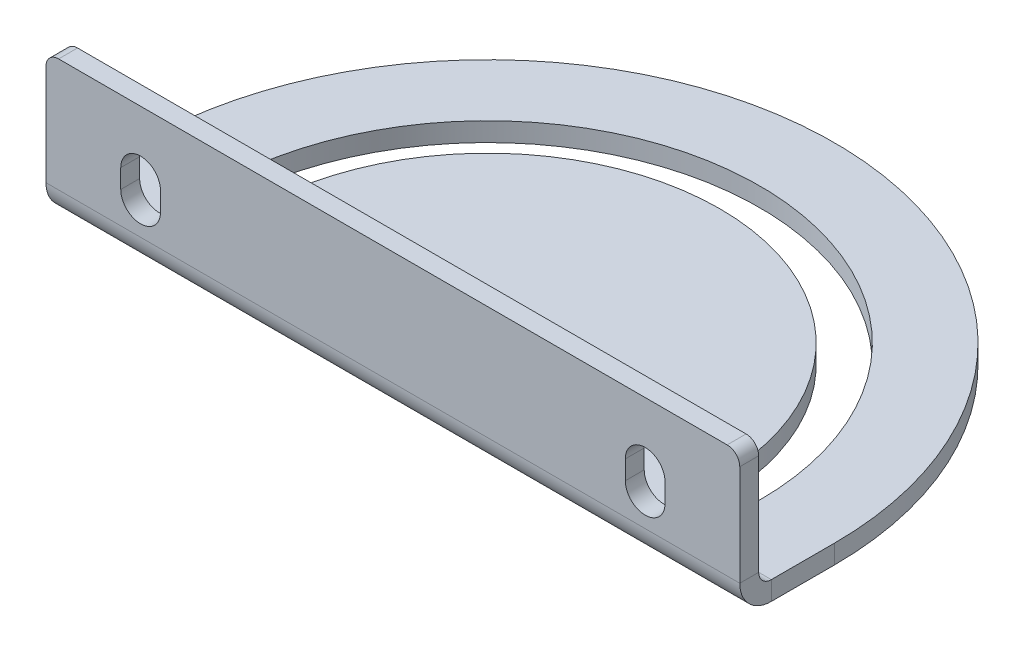
ISO-10303-21;
HEADER;
FILE_DESCRIPTION(('STEP AP214'),'2;1');
FILE_NAME('part.step','',(''),(''),'','','');
FILE_SCHEMA(('AUTOMOTIVE_DESIGN { 1 0 10303 214 1 1 1 1 }'));
ENDSEC;
DATA;
#1=APPLICATION_CONTEXT('core data for automotive mechanical design processes');
#2=APPLICATION_PROTOCOL_DEFINITION('international standard','automotive_design',2000,#1);
#3=PRODUCT_CONTEXT('',#1,'mechanical');
#4=PRODUCT('Part','Part','',(#3));
#5=PRODUCT_RELATED_PRODUCT_CATEGORY('part','',(#4));
#6=PRODUCT_DEFINITION_FORMATION('','',#4);
#7=PRODUCT_DEFINITION_CONTEXT('part definition',#1,'design');
#8=PRODUCT_DEFINITION('design','',#6,#7);
#9=PRODUCT_DEFINITION_SHAPE('','',#8);
#10=(LENGTH_UNIT() NAMED_UNIT(*) SI_UNIT(.MILLI.,.METRE.));
#11=(NAMED_UNIT(*) PLANE_ANGLE_UNIT() SI_UNIT($,.RADIAN.));
#12=(NAMED_UNIT(*) SI_UNIT($,.STERADIAN.) SOLID_ANGLE_UNIT());
#13=UNCERTAINTY_MEASURE_WITH_UNIT(LENGTH_MEASURE(1.E-05),#10,'distance_accuracy_value','');
#14=(GEOMETRIC_REPRESENTATION_CONTEXT(3) GLOBAL_UNCERTAINTY_ASSIGNED_CONTEXT((#13)) GLOBAL_UNIT_ASSIGNED_CONTEXT((#10,
#11,#12)) REPRESENTATION_CONTEXT('',''));
#15=CARTESIAN_POINT('',(0.,0.,0.));
#16=DIRECTION('',(0.,0.,1.));
#17=DIRECTION('',(1.,0.,0.));
#18=AXIS2_PLACEMENT_3D('',#15,#16,#17);
#19=CARTESIAN_POINT('',(-40.,3.,0.));
#20=DIRECTION('',(0.,1.,0.));
#21=DIRECTION('',(0.,0.,1.));
#22=AXIS2_PLACEMENT_3D('',#19,#20,#21);
#23=CYLINDRICAL_SURFACE('',#22,3.15);
#24=DIRECTION('',(0.,1.,0.));
#25=VECTOR('',#24,1.);
#26=CARTESIAN_POINT('',(-36.85,3.,0.));
#27=LINE('',#26,#25);
#28=CARTESIAN_POINT('',(-36.85,0.,0.));
#29=VERTEX_POINT('',#28);
#30=CARTESIAN_POINT('',(-36.85,3.,0.));
#31=VERTEX_POINT('',#30);
#32=EDGE_CURVE('E341',#29,#31,#27,.T.);
#33=ORIENTED_EDGE('',*,*,#32,.F.);
#34=CARTESIAN_POINT('',(-40.,0.,0.));
#35=DIRECTION('',(0.,1.,0.));
#36=DIRECTION('',(0.,0.,1.));
#37=AXIS2_PLACEMENT_3D('',#34,#35,#36);
#38=CIRCLE('',#37,3.15);
#39=CARTESIAN_POINT('',(-43.15,0.,0.));
#40=VERTEX_POINT('',#39);
#41=EDGE_CURVE('E316',#40,#29,#38,.T.);
#42=ORIENTED_EDGE('',*,*,#41,.F.);
#43=DIRECTION('',(0.,1.,0.));
#44=VECTOR('',#43,1.);
#45=CARTESIAN_POINT('',(-43.15,3.,0.));
#46=LINE('',#45,#44);
#47=CARTESIAN_POINT('',(-43.15,3.,0.));
#48=VERTEX_POINT('',#47);
#49=EDGE_CURVE('E339',#40,#48,#46,.T.);
#50=ORIENTED_EDGE('',*,*,#49,.T.);
#51=CARTESIAN_POINT('',(-40.,3.,0.));
#52=DIRECTION('',(0.,1.,0.));
#53=DIRECTION('',(0.,0.,1.));
#54=AXIS2_PLACEMENT_3D('',#51,#52,#53);
#55=CIRCLE('',#54,3.15);
#56=EDGE_CURVE('E261',#48,#31,#55,.T.);
#57=ORIENTED_EDGE('',*,*,#56,.T.);
#58=EDGE_LOOP('',(#33,#42,#50,#57));
#59=FACE_BOUND('',#58,.T.);
#60=ADVANCED_FACE('F16',(#59),#23,.F.);
#61=CARTESIAN_POINT('',(0.,3.,0.));
#62=DIRECTION('',(0.,1.,0.));
#63=DIRECTION('',(0.,0.,1.));
#64=AXIS2_PLACEMENT_3D('',#61,#62,#63);
#65=CYLINDRICAL_SURFACE('',#64,43.15);
#66=ORIENTED_EDGE('',*,*,#49,.F.);
#67=CARTESIAN_POINT('',(0.,0.,0.));
#68=DIRECTION('',(0.,1.,0.));
#69=DIRECTION('',(0.,0.,1.));
#70=AXIS2_PLACEMENT_3D('',#67,#68,#69);
#71=CIRCLE('',#70,43.15);
#72=CARTESIAN_POINT('',(43.15,0.,0.));
#73=VERTEX_POINT('',#72);
#74=EDGE_CURVE('E313',#40,#73,#71,.F.);
#75=ORIENTED_EDGE('',*,*,#74,.T.);
#76=DIRECTION('',(0.,1.,0.));
#77=VECTOR('',#76,1.);
#78=CARTESIAN_POINT('',(43.15,3.,0.));
#79=LINE('',#78,#77);
#80=CARTESIAN_POINT('',(43.15,3.,0.));
#81=VERTEX_POINT('',#80);
#82=EDGE_CURVE('E337',#73,#81,#79,.T.);
#83=ORIENTED_EDGE('',*,*,#82,.T.);
#84=CARTESIAN_POINT('',(0.,3.,0.));
#85=DIRECTION('',(0.,1.,0.));
#86=DIRECTION('',(0.,0.,1.));
#87=AXIS2_PLACEMENT_3D('',#84,#85,#86);
#88=CIRCLE('',#87,43.15);
#89=EDGE_CURVE('E264',#48,#81,#88,.F.);
#90=ORIENTED_EDGE('',*,*,#89,.F.);
#91=EDGE_LOOP('',(#66,#75,#83,#90));
#92=FACE_BOUND('',#91,.T.);
#93=ADVANCED_FACE('F419',(#92),#65,.F.);
#94=CARTESIAN_POINT('',(40.,3.,0.));
#95=DIRECTION('',(0.,1.,0.));
#96=DIRECTION('',(0.,0.,1.));
#97=AXIS2_PLACEMENT_3D('',#94,#95,#96);
#98=CYLINDRICAL_SURFACE('',#97,3.15000000000001);
#99=ORIENTED_EDGE('',*,*,#82,.F.);
#100=CARTESIAN_POINT('',(40.,0.,0.));
#101=DIRECTION('',(0.,1.,0.));
#102=DIRECTION('',(0.,0.,1.));
#103=AXIS2_PLACEMENT_3D('',#100,#101,#102);
#104=CIRCLE('',#103,3.15000000000001);
#105=CARTESIAN_POINT('',(36.85,0.,0.));
#106=VERTEX_POINT('',#105);
#107=EDGE_CURVE('E292',#106,#73,#104,.T.);
#108=ORIENTED_EDGE('',*,*,#107,.F.);
#109=DIRECTION('',(0.,1.,0.));
#110=VECTOR('',#109,1.);
#111=CARTESIAN_POINT('',(36.85,3.,0.));
#112=LINE('',#111,#110);
#113=CARTESIAN_POINT('',(36.85,3.,0.));
#114=VERTEX_POINT('',#113);
#115=EDGE_CURVE('E335',#106,#114,#112,.T.);
#116=ORIENTED_EDGE('',*,*,#115,.T.);
#117=CARTESIAN_POINT('',(40.,3.,0.));
#118=DIRECTION('',(0.,1.,0.));
#119=DIRECTION('',(0.,0.,1.));
#120=AXIS2_PLACEMENT_3D('',#117,#118,#119);
#121=CIRCLE('',#120,3.15000000000001);
#122=EDGE_CURVE('E255',#114,#81,#121,.T.);
#123=ORIENTED_EDGE('',*,*,#122,.T.);
#124=EDGE_LOOP('',(#99,#108,#116,#123));
#125=FACE_BOUND('',#124,.T.);
#126=ADVANCED_FACE('F425',(#125),#98,.F.);
#127=CARTESIAN_POINT('',(-55.,23.,12.));
#128=DIRECTION('',(-1.,0.,0.));
#129=DIRECTION('',(0.,-1.,0.));
#130=AXIS2_PLACEMENT_3D('',#127,#128,#129);
#131=PLANE('',#130);
#132=DIRECTION('',(0.,1.,0.));
#133=VECTOR('',#132,1.);
#134=CARTESIAN_POINT('',(-55.,23.,15.));
#135=LINE('',#134,#133);
#136=CARTESIAN_POINT('',(-55.,21.,15.));
#137=VERTEX_POINT('',#136);
#138=CARTESIAN_POINT('',(-55.,5.,15.));
#139=VERTEX_POINT('',#138);
#140=EDGE_CURVE('E303',#137,#139,#135,.F.);
#141=ORIENTED_EDGE('',*,*,#140,.F.);
#142=DIRECTION('',(0.,0.,-1.));
#143=VECTOR('',#142,1.);
#144=CARTESIAN_POINT('',(-55.,21.,12.));
#145=LINE('',#144,#143);
#146=CARTESIAN_POINT('',(-55.,21.,12.));
#147=VERTEX_POINT('',#146);
#148=EDGE_CURVE('E343',#137,#147,#145,.T.);
#149=ORIENTED_EDGE('',*,*,#148,.T.);
#150=DIRECTION('',(0.,-1.,0.));
#151=VECTOR('',#150,1.);
#152=CARTESIAN_POINT('',(-55.,23.,12.));
#153=LINE('',#152,#151);
#154=CARTESIAN_POINT('',(-55.,5.,12.));
#155=VERTEX_POINT('',#154);
#156=EDGE_CURVE('E239',#147,#155,#153,.T.);
#157=ORIENTED_EDGE('',*,*,#156,.T.);
#158=DIRECTION('',(0.,0.,-1.));
#159=VECTOR('',#158,1.);
#160=CARTESIAN_POINT('',(-55.,5.,12.));
#161=LINE('',#160,#159);
#162=EDGE_CURVE('E332',#139,#155,#161,.T.);
#163=ORIENTED_EDGE('',*,*,#162,.F.);
#164=EDGE_LOOP('',(#141,#149,#157,#163));
#165=FACE_BOUND('',#164,.T.);
#166=ADVANCED_FACE('F364',(#165),#131,.T.);
#167=CARTESIAN_POINT('',(-55.,23.,12.));
#168=DIRECTION('',(0.,1.,0.));
#169=DIRECTION('',(-1.,0.,0.));
#170=AXIS2_PLACEMENT_3D('',#167,#168,#169);
#171=PLANE('',#170);
#172=DIRECTION('',(-1.,0.,0.));
#173=VECTOR('',#172,1.);
#174=CARTESIAN_POINT('',(-55.,23.,12.));
#175=LINE('',#174,#173);
#176=CARTESIAN_POINT('',(53.,23.,12.));
#177=VERTEX_POINT('',#176);
#178=CARTESIAN_POINT('',(-53.,23.,12.));
#179=VERTEX_POINT('',#178);
#180=EDGE_CURVE('E241',#177,#179,#175,.T.);
#181=ORIENTED_EDGE('',*,*,#180,.T.);
#182=DIRECTION('',(0.,0.,-1.));
#183=VECTOR('',#182,1.);
#184=CARTESIAN_POINT('',(-53.,23.,12.));
#185=LINE('',#184,#183);
#186=CARTESIAN_POINT('',(-53.,23.,15.));
#187=VERTEX_POINT('',#186);
#188=EDGE_CURVE('E37',#179,#187,#185,.F.);
#189=ORIENTED_EDGE('',*,*,#188,.T.);
#190=DIRECTION('',(1.,0.,0.));
#191=VECTOR('',#190,1.);
#192=CARTESIAN_POINT('',(-55.,23.,15.));
#193=LINE('',#192,#191);
#194=CARTESIAN_POINT('',(53.,23.,15.));
#195=VERTEX_POINT('',#194);
#196=EDGE_CURVE('E305',#195,#187,#193,.F.);
#197=ORIENTED_EDGE('',*,*,#196,.F.);
#198=DIRECTION('',(0.,0.,1.));
#199=VECTOR('',#198,1.);
#200=CARTESIAN_POINT('',(53.,23.,12.));
#201=LINE('',#200,#199);
#202=EDGE_CURVE('E351',#195,#177,#201,.F.);
#203=ORIENTED_EDGE('',*,*,#202,.T.);
#204=EDGE_LOOP('',(#181,#189,#197,#203));
#205=FACE_BOUND('',#204,.T.);
#206=ADVANCED_FACE('F370',(#205),#171,.T.);
#207=CARTESIAN_POINT('',(55.,23.,12.));
#208=DIRECTION('',(-1.,0.,0.));
#209=DIRECTION('',(0.,-1.,0.));
#210=AXIS2_PLACEMENT_3D('',#207,#208,#209);
#211=PLANE('',#210);
#212=DIRECTION('',(0.,-1.,0.));
#213=VECTOR('',#212,1.);
#214=CARTESIAN_POINT('',(55.,23.,12.));
#215=LINE('',#214,#213);
#216=CARTESIAN_POINT('',(55.,21.,12.));
#217=VERTEX_POINT('',#216);
#218=CARTESIAN_POINT('',(55.,5.,12.));
#219=VERTEX_POINT('',#218);
#220=EDGE_CURVE('E244',#217,#219,#215,.T.);
#221=ORIENTED_EDGE('',*,*,#220,.F.);
#222=DIRECTION('',(0.,0.,-1.));
#223=VECTOR('',#222,1.);
#224=CARTESIAN_POINT('',(55.,21.,12.));
#225=LINE('',#224,#223);
#226=CARTESIAN_POINT('',(55.,21.,15.));
#227=VERTEX_POINT('',#226);
#228=EDGE_CURVE('E10',#217,#227,#225,.F.);
#229=ORIENTED_EDGE('',*,*,#228,.T.);
#230=DIRECTION('',(0.,1.,0.));
#231=VECTOR('',#230,1.);
#232=CARTESIAN_POINT('',(55.,23.,15.));
#233=LINE('',#232,#231);
#234=CARTESIAN_POINT('',(55.,5.,15.));
#235=VERTEX_POINT('',#234);
#236=EDGE_CURVE('E299',#227,#235,#233,.F.);
#237=ORIENTED_EDGE('',*,*,#236,.T.);
#238=DIRECTION('',(0.,0.,-1.));
#239=VECTOR('',#238,1.);
#240=CARTESIAN_POINT('',(55.,5.,12.));
#241=LINE('',#240,#239);
#242=EDGE_CURVE('E329',#235,#219,#241,.T.);
#243=ORIENTED_EDGE('',*,*,#242,.T.);
#244=EDGE_LOOP('',(#221,#229,#237,#243));
#245=FACE_BOUND('',#244,.T.);
#246=ADVANCED_FACE('F374',(#245),#211,.F.);
#247=CARTESIAN_POINT('',(55.,5.,9.99999999999999));
#248=DIRECTION('',(1.,0.,0.));
#249=DIRECTION('',(0.,0.,-1.));
#250=AXIS2_PLACEMENT_3D('',#247,#248,#249);
#251=PLANE('',#250);
#252=ORIENTED_EDGE('',*,*,#242,.F.);
#253=CARTESIAN_POINT('',(55.,5.,9.99999999999999));
#254=DIRECTION('',(-1.,0.,0.));
#255=DIRECTION('',(0.,0.,1.));
#256=AXIS2_PLACEMENT_3D('',#253,#254,#255);
#257=CIRCLE('',#256,5.);
#258=CARTESIAN_POINT('',(55.,0.,9.99999999999999));
#259=VERTEX_POINT('',#258);
#260=EDGE_CURVE('E300',#235,#259,#257,.F.);
#261=ORIENTED_EDGE('',*,*,#260,.T.);
#262=DIRECTION('',(0.,1.,0.));
#263=VECTOR('',#262,1.);
#264=CARTESIAN_POINT('',(55.,3.,9.99999999999999));
#265=LINE('',#264,#263);
#266=CARTESIAN_POINT('',(55.,3.,9.99999999999999));
#267=VERTEX_POINT('',#266);
#268=EDGE_CURVE('E327',#259,#267,#265,.T.);
#269=ORIENTED_EDGE('',*,*,#268,.T.);
#270=CARTESIAN_POINT('',(55.,5.,9.99999999999999));
#271=DIRECTION('',(-1.,0.,0.));
#272=DIRECTION('',(0.,0.,1.));
#273=AXIS2_PLACEMENT_3D('',#270,#271,#272);
#274=CIRCLE('',#273,2.);
#275=EDGE_CURVE('E242',#219,#267,#274,.F.);
#276=ORIENTED_EDGE('',*,*,#275,.F.);
#277=EDGE_LOOP('',(#252,#261,#269,#276));
#278=FACE_BOUND('',#277,.T.);
#279=ADVANCED_FACE('F379',(#278),#251,.T.);
#280=CARTESIAN_POINT('',(55.,3.,0.));
#281=DIRECTION('',(1.,0.,0.));
#282=DIRECTION('',(0.,0.,-1.));
#283=AXIS2_PLACEMENT_3D('',#280,#281,#282);
#284=PLANE('',#283);
#285=ORIENTED_EDGE('',*,*,#268,.F.);
#286=DIRECTION('',(0.,0.,1.));
#287=VECTOR('',#286,1.);
#288=CARTESIAN_POINT('',(55.,0.,0.));
#289=LINE('',#288,#287);
#290=CARTESIAN_POINT('',(55.,0.,0.));
#291=VERTEX_POINT('',#290);
#292=EDGE_CURVE('E296',#259,#291,#289,.F.);
#293=ORIENTED_EDGE('',*,*,#292,.T.);
#294=DIRECTION('',(0.,1.,0.));
#295=VECTOR('',#294,1.);
#296=CARTESIAN_POINT('',(55.,3.,0.));
#297=LINE('',#296,#295);
#298=CARTESIAN_POINT('',(55.,3.,0.));
#299=VERTEX_POINT('',#298);
#300=EDGE_CURVE('E325',#291,#299,#297,.T.);
#301=ORIENTED_EDGE('',*,*,#300,.T.);
#302=DIRECTION('',(0.,0.,-1.));
#303=VECTOR('',#302,1.);
#304=CARTESIAN_POINT('',(55.,3.,0.));
#305=LINE('',#304,#303);
#306=EDGE_CURVE('E246',#267,#299,#305,.T.);
#307=ORIENTED_EDGE('',*,*,#306,.F.);
#308=EDGE_LOOP('',(#285,#293,#301,#307));
#309=FACE_BOUND('',#308,.T.);
#310=ADVANCED_FACE('F617',(#309),#284,.T.);
#311=CARTESIAN_POINT('',(0.,3.,0.));
#312=DIRECTION('',(0.,1.,0.));
#313=DIRECTION('',(0.,0.,1.));
#314=AXIS2_PLACEMENT_3D('',#311,#312,#313);
#315=CYLINDRICAL_SURFACE('',#314,55.);
#316=ORIENTED_EDGE('',*,*,#300,.F.);
#317=CARTESIAN_POINT('',(0.,0.,0.));
#318=DIRECTION('',(0.,1.,0.));
#319=DIRECTION('',(0.,0.,1.));
#320=AXIS2_PLACEMENT_3D('',#317,#318,#319);
#321=CIRCLE('',#320,55.);
#322=CARTESIAN_POINT('',(-55.,0.,0.));
#323=VERTEX_POINT('',#322);
#324=EDGE_CURVE('E293',#291,#323,#321,.T.);
#325=ORIENTED_EDGE('',*,*,#324,.T.);
#326=DIRECTION('',(0.,1.,0.));
#327=VECTOR('',#326,1.);
#328=CARTESIAN_POINT('',(-55.,3.,0.));
#329=LINE('',#328,#327);
#330=CARTESIAN_POINT('',(-55.,3.,0.));
#331=VERTEX_POINT('',#330);
#332=EDGE_CURVE('E323',#323,#331,#329,.T.);
#333=ORIENTED_EDGE('',*,*,#332,.T.);
#334=CARTESIAN_POINT('',(0.,3.,0.));
#335=DIRECTION('',(0.,1.,0.));
#336=DIRECTION('',(0.,0.,1.));
#337=AXIS2_PLACEMENT_3D('',#334,#335,#336);
#338=CIRCLE('',#337,55.);
#339=EDGE_CURVE('E249',#299,#331,#338,.T.);
#340=ORIENTED_EDGE('',*,*,#339,.F.);
#341=EDGE_LOOP('',(#316,#325,#333,#340));
#342=FACE_BOUND('',#341,.T.);
#343=ADVANCED_FACE('F626',(#342),#315,.T.);
#344=CARTESIAN_POINT('',(-55.,3.,0.));
#345=DIRECTION('',(1.,0.,0.));
#346=DIRECTION('',(0.,0.,-1.));
#347=AXIS2_PLACEMENT_3D('',#344,#345,#346);
#348=PLANE('',#347);
#349=ORIENTED_EDGE('',*,*,#332,.F.);
#350=DIRECTION('',(0.,0.,1.));
#351=VECTOR('',#350,1.);
#352=CARTESIAN_POINT('',(-55.,0.,0.));
#353=LINE('',#352,#351);
#354=CARTESIAN_POINT('',(-55.,0.,9.99999999999999));
#355=VERTEX_POINT('',#354);
#356=EDGE_CURVE('E289',#355,#323,#353,.F.);
#357=ORIENTED_EDGE('',*,*,#356,.F.);
#358=DIRECTION('',(0.,1.,0.));
#359=VECTOR('',#358,1.);
#360=CARTESIAN_POINT('',(-55.,3.,9.99999999999999));
#361=LINE('',#360,#359);
#362=CARTESIAN_POINT('',(-55.,3.,9.99999999999999));
#363=VERTEX_POINT('',#362);
#364=EDGE_CURVE('E276',#355,#363,#361,.T.);
#365=ORIENTED_EDGE('',*,*,#364,.T.);
#366=DIRECTION('',(0.,0.,-1.));
#367=VECTOR('',#366,1.);
#368=CARTESIAN_POINT('',(-55.,3.,0.));
#369=LINE('',#368,#367);
#370=EDGE_CURVE('E252',#363,#331,#369,.T.);
#371=ORIENTED_EDGE('',*,*,#370,.T.);
#372=EDGE_LOOP('',(#349,#357,#365,#371));
#373=FACE_BOUND('',#372,.T.);
#374=ADVANCED_FACE('F394',(#373),#348,.F.);
#375=CARTESIAN_POINT('',(-55.,5.,9.99999999999999));
#376=DIRECTION('',(-1.,0.,0.));
#377=DIRECTION('',(0.,0.,1.));
#378=AXIS2_PLACEMENT_3D('',#375,#376,#377);
#379=PLANE('',#378);
#380=CARTESIAN_POINT('',(-55.,5.,9.99999999999999));
#381=DIRECTION('',(-1.,0.,0.));
#382=DIRECTION('',(0.,0.,1.));
#383=AXIS2_PLACEMENT_3D('',#380,#381,#382);
#384=CIRCLE('',#383,5.);
#385=EDGE_CURVE('E238',#355,#139,#384,.T.);
#386=ORIENTED_EDGE('',*,*,#385,.T.);
#387=ORIENTED_EDGE('',*,*,#162,.T.);
#388=CARTESIAN_POINT('',(-55.,5.,9.99999999999999));
#389=DIRECTION('',(1.,0.,0.));
#390=DIRECTION('',(0.,0.,-1.));
#391=AXIS2_PLACEMENT_3D('',#388,#389,#390);
#392=CIRCLE('',#391,2.);
#393=EDGE_CURVE('E277',#363,#155,#392,.F.);
#394=ORIENTED_EDGE('',*,*,#393,.F.);
#395=ORIENTED_EDGE('',*,*,#364,.F.);
#396=EDGE_LOOP('',(#386,#387,#394,#395));
#397=FACE_BOUND('',#396,.T.);
#398=ADVANCED_FACE('F387',(#397),#379,.T.);
#399=CARTESIAN_POINT('',(0.,3.,0.));
#400=DIRECTION('',(0.,1.,0.));
#401=DIRECTION('',(0.,0.,1.));
#402=AXIS2_PLACEMENT_3D('',#399,#400,#401);
#403=CYLINDRICAL_SURFACE('',#402,36.85);
#404=CARTESIAN_POINT('',(0.,0.,0.));
#405=DIRECTION('',(0.,1.,0.));
#406=DIRECTION('',(0.,0.,1.));
#407=AXIS2_PLACEMENT_3D('',#404,#405,#406);
#408=CIRCLE('',#407,36.85);
#409=EDGE_CURVE('E312',#29,#106,#408,.F.);
#410=ORIENTED_EDGE('',*,*,#409,.F.);
#411=ORIENTED_EDGE('',*,*,#32,.T.);
#412=CARTESIAN_POINT('',(0.,3.,0.));
#413=DIRECTION('',(0.,1.,0.));
#414=DIRECTION('',(0.,0.,1.));
#415=AXIS2_PLACEMENT_3D('',#412,#413,#414);
#416=CIRCLE('',#415,36.85);
#417=EDGE_CURVE('E258',#31,#114,#416,.F.);
#418=ORIENTED_EDGE('',*,*,#417,.T.);
#419=ORIENTED_EDGE('',*,*,#115,.F.);
#420=EDGE_LOOP('',(#410,#411,#418,#419));
#421=FACE_BOUND('',#420,.T.);
#422=ADVANCED_FACE('F430',(#421),#403,.T.);
#423=CARTESIAN_POINT('',(0.,3.,0.));
#424=DIRECTION('',(0.,1.,0.));
#425=DIRECTION('',(0.,0.,1.));
#426=AXIS2_PLACEMENT_3D('',#423,#424,#425);
#427=CYLINDRICAL_SURFACE('',#426,3.14999999999999);
#428=CARTESIAN_POINT('',(0.,3.,0.));
#429=DIRECTION('',(0.,1.,0.));
#430=DIRECTION('',(0.,0.,1.));
#431=AXIS2_PLACEMENT_3D('',#428,#429,#430);
#432=CIRCLE('',#431,3.14999999999999);
#433=CARTESIAN_POINT('',(0.,3.,3.14999999999999));
#434=VERTEX_POINT('',#433);
#435=EDGE_CURVE('E267',#434,#434,#432,.T.);
#436=ORIENTED_EDGE('',*,*,#435,.T.);
#437=EDGE_LOOP('',(#436));
#438=FACE_BOUND('',#437,.T.);
#439=CARTESIAN_POINT('',(0.,0.,0.));
#440=DIRECTION('',(0.,1.,0.));
#441=DIRECTION('',(0.,0.,1.));
#442=AXIS2_PLACEMENT_3D('',#439,#440,#441);
#443=CIRCLE('',#442,3.14999999999999);
#444=CARTESIAN_POINT('',(0.,0.,3.14999999999999));
#445=VERTEX_POINT('',#444);
#446=EDGE_CURVE('E288',#445,#445,#443,.T.);
#447=ORIENTED_EDGE('',*,*,#446,.F.);
#448=EDGE_LOOP('',(#447));
#449=FACE_BOUND('',#448,.T.);
#450=ADVANCED_FACE('F433',(#438,#449),#427,.F.);
#451=CARTESIAN_POINT('',(0.,3.,0.));
#452=DIRECTION('',(0.,1.,0.));
#453=DIRECTION('',(0.,0.,1.));
#454=AXIS2_PLACEMENT_3D('',#451,#452,#453);
#455=PLANE('',#454);
#456=ORIENTED_EDGE('',*,*,#370,.F.);
#457=DIRECTION('',(-1.,0.,0.));
#458=VECTOR('',#457,1.);
#459=CARTESIAN_POINT('',(0.,3.,9.99999999999999));
#460=LINE('',#459,#458);
#461=EDGE_CURVE('E273',#363,#267,#460,.F.);
#462=ORIENTED_EDGE('',*,*,#461,.T.);
#463=ORIENTED_EDGE('',*,*,#306,.T.);
#464=ORIENTED_EDGE('',*,*,#339,.T.);
#465=EDGE_LOOP('',(#456,#462,#463,#464));
#466=FACE_BOUND('',#465,.T.);
#467=ORIENTED_EDGE('',*,*,#122,.F.);
#468=ORIENTED_EDGE('',*,*,#417,.F.);
#469=ORIENTED_EDGE('',*,*,#56,.F.);
#470=ORIENTED_EDGE('',*,*,#89,.T.);
#471=EDGE_LOOP('',(#467,#468,#469,#470));
#472=FACE_BOUND('',#471,.T.);
#473=ORIENTED_EDGE('',*,*,#435,.F.);
#474=EDGE_LOOP('',(#473));
#475=FACE_BOUND('',#474,.T.);
#476=ADVANCED_FACE('F390',(#466,#472,#475),#455,.T.);
#477=CARTESIAN_POINT('',(-55.,23.,12.));
#478=DIRECTION('',(0.,0.,1.));
#479=DIRECTION('',(1.,0.,0.));
#480=AXIS2_PLACEMENT_3D('',#477,#478,#479);
#481=PLANE('',#480);
#482=CARTESIAN_POINT('',(40.,10.,12.));
#483=DIRECTION('',(0.,0.,-1.));
#484=DIRECTION('',(1.,0.,0.));
#485=AXIS2_PLACEMENT_3D('',#482,#483,#484);
#486=CIRCLE('',#485,3.14999999999999);
#487=CARTESIAN_POINT('',(43.15,10.,12.));
#488=VERTEX_POINT('',#487);
#489=CARTESIAN_POINT('',(36.85,10.,12.));
#490=VERTEX_POINT('',#489);
#491=EDGE_CURVE('E191',#488,#490,#486,.T.);
#492=ORIENTED_EDGE('',*,*,#491,.F.);
#493=DIRECTION('',(0.,-1.,0.));
#494=VECTOR('',#493,1.);
#495=CARTESIAN_POINT('',(43.15,13.,12.));
#496=LINE('',#495,#494);
#497=CARTESIAN_POINT('',(43.15,13.,12.));
#498=VERTEX_POINT('',#497);
#499=EDGE_CURVE('E183',#498,#488,#496,.T.);
#500=ORIENTED_EDGE('',*,*,#499,.F.);
#501=CARTESIAN_POINT('',(40.,13.,12.));
#502=DIRECTION('',(0.,0.,-1.));
#503=DIRECTION('',(1.,0.,0.));
#504=AXIS2_PLACEMENT_3D('',#501,#502,#503);
#505=CIRCLE('',#504,3.14999999999999);
#506=CARTESIAN_POINT('',(36.85,13.,12.));
#507=VERTEX_POINT('',#506);
#508=EDGE_CURVE('E195',#507,#498,#505,.T.);
#509=ORIENTED_EDGE('',*,*,#508,.F.);
#510=DIRECTION('',(0.,1.,0.));
#511=VECTOR('',#510,1.);
#512=CARTESIAN_POINT('',(36.85,13.,12.));
#513=LINE('',#512,#511);
#514=EDGE_CURVE('E189',#490,#507,#513,.T.);
#515=ORIENTED_EDGE('',*,*,#514,.F.);
#516=EDGE_LOOP('',(#492,#500,#509,#515));
#517=FACE_BOUND('',#516,.T.);
#518=CARTESIAN_POINT('',(-40.,10.,12.));
#519=DIRECTION('',(0.,0.,-1.));
#520=DIRECTION('',(-1.,0.,0.));
#521=AXIS2_PLACEMENT_3D('',#518,#519,#520);
#522=CIRCLE('',#521,3.14999999999999);
#523=CARTESIAN_POINT('',(-36.85,10.,12.));
#524=VERTEX_POINT('',#523);
#525=CARTESIAN_POINT('',(-43.15,10.,12.));
#526=VERTEX_POINT('',#525);
#527=EDGE_CURVE('E210',#524,#526,#522,.T.);
#528=ORIENTED_EDGE('',*,*,#527,.F.);
#529=DIRECTION('',(0.,-1.,0.));
#530=VECTOR('',#529,1.);
#531=CARTESIAN_POINT('',(-36.85,13.,12.));
#532=LINE('',#531,#530);
#533=CARTESIAN_POINT('',(-36.85,13.,12.));
#534=VERTEX_POINT('',#533);
#535=EDGE_CURVE('E213',#534,#524,#532,.T.);
#536=ORIENTED_EDGE('',*,*,#535,.F.);
#537=CARTESIAN_POINT('',(-40.,13.,12.));
#538=DIRECTION('',(0.,0.,-1.));
#539=DIRECTION('',(-1.,0.,0.));
#540=AXIS2_PLACEMENT_3D('',#537,#538,#539);
#541=CIRCLE('',#540,3.14999999999999);
#542=CARTESIAN_POINT('',(-43.15,13.,12.));
#543=VERTEX_POINT('',#542);
#544=EDGE_CURVE('E206',#543,#534,#541,.T.);
#545=ORIENTED_EDGE('',*,*,#544,.F.);
#546=DIRECTION('',(0.,1.,0.));
#547=VECTOR('',#546,1.);
#548=CARTESIAN_POINT('',(-43.15,13.,12.));
#549=LINE('',#548,#547);
#550=EDGE_CURVE('E207',#526,#543,#549,.T.);
#551=ORIENTED_EDGE('',*,*,#550,.F.);
#552=EDGE_LOOP('',(#528,#536,#545,#551));
#553=FACE_BOUND('',#552,.T.);
#554=ORIENTED_EDGE('',*,*,#156,.F.);
#555=CARTESIAN_POINT('',(-53.,21.,12.));
#556=DIRECTION('',(0.,0.,1.));
#557=DIRECTION('',(1.,0.,0.));
#558=AXIS2_PLACEMENT_3D('',#555,#556,#557);
#559=CIRCLE('',#558,2.);
#560=EDGE_CURVE('E349',#147,#179,#559,.F.);
#561=ORIENTED_EDGE('',*,*,#560,.T.);
#562=ORIENTED_EDGE('',*,*,#180,.F.);
#563=CARTESIAN_POINT('',(53.,21.,12.));
#564=DIRECTION('',(0.,0.,1.));
#565=DIRECTION('',(1.,0.,0.));
#566=AXIS2_PLACEMENT_3D('',#563,#564,#565);
#567=CIRCLE('',#566,2.);
#568=EDGE_CURVE('E347',#177,#217,#567,.F.);
#569=ORIENTED_EDGE('',*,*,#568,.T.);
#570=ORIENTED_EDGE('',*,*,#220,.T.);
#571=DIRECTION('',(-1.,0.,0.));
#572=VECTOR('',#571,1.);
#573=CARTESIAN_POINT('',(-55.,5.,12.));
#574=LINE('',#573,#572);
#575=EDGE_CURVE('E270',#219,#155,#574,.T.);
#576=ORIENTED_EDGE('',*,*,#575,.T.);
#577=EDGE_LOOP('',(#554,#561,#562,#569,#570,#576));
#578=FACE_BOUND('',#577,.T.);
#579=ADVANCED_FACE('F369',(#517,#553,#578),#481,.F.);
#580=CARTESIAN_POINT('',(-55.,5.,9.99999999999999));
#581=DIRECTION('',(-1.,0.,0.));
#582=DIRECTION('',(0.,0.,1.));
#583=AXIS2_PLACEMENT_3D('',#580,#581,#582);
#584=CYLINDRICAL_SURFACE('',#583,2.);
#585=ORIENTED_EDGE('',*,*,#275,.T.);
#586=ORIENTED_EDGE('',*,*,#461,.F.);
#587=ORIENTED_EDGE('',*,*,#393,.T.);
#588=ORIENTED_EDGE('',*,*,#575,.F.);
#589=EDGE_LOOP('',(#585,#586,#587,#588));
#590=FACE_BOUND('',#589,.T.);
#591=ADVANCED_FACE('F383',(#590),#584,.F.);
#592=CARTESIAN_POINT('',(0.,0.,0.));
#593=DIRECTION('',(0.,1.,0.));
#594=DIRECTION('',(0.,0.,1.));
#595=AXIS2_PLACEMENT_3D('',#592,#593,#594);
#596=PLANE('',#595);
#597=ORIENTED_EDGE('',*,*,#356,.T.);
#598=ORIENTED_EDGE('',*,*,#324,.F.);
#599=ORIENTED_EDGE('',*,*,#292,.F.);
#600=DIRECTION('',(1.,0.,0.));
#601=VECTOR('',#600,1.);
#602=CARTESIAN_POINT('',(0.,0.,9.99999999999999));
#603=LINE('',#602,#601);
#604=EDGE_CURVE('E280',#355,#259,#603,.T.);
#605=ORIENTED_EDGE('',*,*,#604,.F.);
#606=EDGE_LOOP('',(#597,#598,#599,#605));
#607=FACE_BOUND('',#606,.T.);
#608=ORIENTED_EDGE('',*,*,#107,.T.);
#609=ORIENTED_EDGE('',*,*,#74,.F.);
#610=ORIENTED_EDGE('',*,*,#41,.T.);
#611=ORIENTED_EDGE('',*,*,#409,.T.);
#612=EDGE_LOOP('',(#608,#609,#610,#611));
#613=FACE_BOUND('',#612,.T.);
#614=ORIENTED_EDGE('',*,*,#446,.T.);
#615=EDGE_LOOP('',(#614));
#616=FACE_BOUND('',#615,.T.);
#617=ADVANCED_FACE('F398',(#607,#613,#616),#596,.F.);
#618=CARTESIAN_POINT('',(-55.,23.,15.));
#619=DIRECTION('',(0.,0.,1.));
#620=DIRECTION('',(1.,0.,0.));
#621=AXIS2_PLACEMENT_3D('',#618,#619,#620);
#622=PLANE('',#621);
#623=DIRECTION('',(0.,-1.,0.));
#624=VECTOR('',#623,1.);
#625=CARTESIAN_POINT('',(43.15,13.,15.));
#626=LINE('',#625,#624);
#627=CARTESIAN_POINT('',(43.15,13.,15.));
#628=VERTEX_POINT('',#627);
#629=CARTESIAN_POINT('',(43.15,10.,15.));
#630=VERTEX_POINT('',#629);
#631=EDGE_CURVE('E180',#628,#630,#626,.T.);
#632=ORIENTED_EDGE('',*,*,#631,.T.);
#633=CARTESIAN_POINT('',(40.,10.,15.));
#634=DIRECTION('',(0.,0.,1.));
#635=DIRECTION('',(1.,0.,0.));
#636=AXIS2_PLACEMENT_3D('',#633,#634,#635);
#637=CIRCLE('',#636,3.14999999999999);
#638=CARTESIAN_POINT('',(36.85,10.,15.));
#639=VERTEX_POINT('',#638);
#640=EDGE_CURVE('E166',#630,#639,#637,.F.);
#641=ORIENTED_EDGE('',*,*,#640,.T.);
#642=DIRECTION('',(0.,1.,0.));
#643=VECTOR('',#642,1.);
#644=CARTESIAN_POINT('',(36.85,13.,15.));
#645=LINE('',#644,#643);
#646=CARTESIAN_POINT('',(36.85,13.,15.));
#647=VERTEX_POINT('',#646);
#648=EDGE_CURVE('E200',#639,#647,#645,.T.);
#649=ORIENTED_EDGE('',*,*,#648,.T.);
#650=CARTESIAN_POINT('',(40.,13.,15.));
#651=DIRECTION('',(0.,0.,1.));
#652=DIRECTION('',(1.,0.,0.));
#653=AXIS2_PLACEMENT_3D('',#650,#651,#652);
#654=CIRCLE('',#653,3.14999999999999);
#655=EDGE_CURVE('E188',#647,#628,#654,.F.);
#656=ORIENTED_EDGE('',*,*,#655,.T.);
#657=EDGE_LOOP('',(#632,#641,#649,#656));
#658=FACE_BOUND('',#657,.T.);
#659=DIRECTION('',(0.,-1.,0.));
#660=VECTOR('',#659,1.);
#661=CARTESIAN_POINT('',(-36.85,13.,15.));
#662=LINE('',#661,#660);
#663=CARTESIAN_POINT('',(-36.85,13.,15.));
#664=VERTEX_POINT('',#663);
#665=CARTESIAN_POINT('',(-36.85,10.,15.));
#666=VERTEX_POINT('',#665);
#667=EDGE_CURVE('E209',#664,#666,#662,.T.);
#668=ORIENTED_EDGE('',*,*,#667,.T.);
#669=CARTESIAN_POINT('',(-40.,10.,15.));
#670=DIRECTION('',(0.,0.,1.));
#671=DIRECTION('',(1.,0.,0.));
#672=AXIS2_PLACEMENT_3D('',#669,#670,#671);
#673=CIRCLE('',#672,3.14999999999999);
#674=CARTESIAN_POINT('',(-43.15,10.,15.));
#675=VERTEX_POINT('',#674);
#676=EDGE_CURVE('E230',#666,#675,#673,.F.);
#677=ORIENTED_EDGE('',*,*,#676,.T.);
#678=DIRECTION('',(0.,1.,0.));
#679=VECTOR('',#678,1.);
#680=CARTESIAN_POINT('',(-43.15,13.,15.));
#681=LINE('',#680,#679);
#682=CARTESIAN_POINT('',(-43.15,13.,15.));
#683=VERTEX_POINT('',#682);
#684=EDGE_CURVE('E226',#675,#683,#681,.T.);
#685=ORIENTED_EDGE('',*,*,#684,.T.);
#686=CARTESIAN_POINT('',(-40.,13.,15.));
#687=DIRECTION('',(0.,0.,1.));
#688=DIRECTION('',(1.,0.,0.));
#689=AXIS2_PLACEMENT_3D('',#686,#687,#688);
#690=CIRCLE('',#689,3.14999999999999);
#691=EDGE_CURVE('E221',#683,#664,#690,.F.);
#692=ORIENTED_EDGE('',*,*,#691,.T.);
#693=EDGE_LOOP('',(#668,#677,#685,#692));
#694=FACE_BOUND('',#693,.T.);
#695=ORIENTED_EDGE('',*,*,#196,.T.);
#696=CARTESIAN_POINT('',(-53.,21.,15.));
#697=DIRECTION('',(0.,0.,1.));
#698=DIRECTION('',(1.,0.,0.));
#699=AXIS2_PLACEMENT_3D('',#696,#697,#698);
#700=CIRCLE('',#699,2.);
#701=EDGE_CURVE('E24',#187,#137,#700,.T.);
#702=ORIENTED_EDGE('',*,*,#701,.T.);
#703=ORIENTED_EDGE('',*,*,#140,.T.);
#704=DIRECTION('',(1.,0.,0.));
#705=VECTOR('',#704,1.);
#706=CARTESIAN_POINT('',(-55.,5.,15.));
#707=LINE('',#706,#705);
#708=EDGE_CURVE('E285',#235,#139,#707,.F.);
#709=ORIENTED_EDGE('',*,*,#708,.F.);
#710=ORIENTED_EDGE('',*,*,#236,.F.);
#711=CARTESIAN_POINT('',(53.,21.,15.));
#712=DIRECTION('',(0.,0.,1.));
#713=DIRECTION('',(1.,0.,0.));
#714=AXIS2_PLACEMENT_3D('',#711,#712,#713);
#715=CIRCLE('',#714,2.);
#716=EDGE_CURVE('E355',#227,#195,#715,.T.);
#717=ORIENTED_EDGE('',*,*,#716,.T.);
#718=EDGE_LOOP('',(#695,#702,#703,#709,#710,#717));
#719=FACE_BOUND('',#718,.T.);
#720=ADVANCED_FACE('F186',(#658,#694,#719),#622,.T.);
#721=CARTESIAN_POINT('',(-55.,5.,9.99999999999999));
#722=DIRECTION('',(-1.,0.,0.));
#723=DIRECTION('',(0.,0.,1.));
#724=AXIS2_PLACEMENT_3D('',#721,#722,#723);
#725=CYLINDRICAL_SURFACE('',#724,5.);
#726=ORIENTED_EDGE('',*,*,#260,.F.);
#727=ORIENTED_EDGE('',*,*,#708,.T.);
#728=ORIENTED_EDGE('',*,*,#385,.F.);
#729=ORIENTED_EDGE('',*,*,#604,.T.);
#730=EDGE_LOOP('',(#726,#727,#728,#729));
#731=FACE_BOUND('',#730,.T.);
#732=ADVANCED_FACE('F404',(#731),#725,.T.);
#733=CARTESIAN_POINT('',(-36.85,13.,26.2329871361094));
#734=DIRECTION('',(1.,0.,0.));
#735=DIRECTION('',(0.,0.,-1.));
#736=AXIS2_PLACEMENT_3D('',#733,#734,#735);
#737=PLANE('',#736);
#738=DIRECTION('',(0.,0.,-1.));
#739=VECTOR('',#738,1.);
#740=CARTESIAN_POINT('',(-36.85,13.,26.2329871361094));
#741=LINE('',#740,#739);
#742=EDGE_CURVE('E224',#664,#534,#741,.T.);
#743=ORIENTED_EDGE('',*,*,#742,.T.);
#744=ORIENTED_EDGE('',*,*,#535,.T.);
#745=DIRECTION('',(0.,0.,-1.));
#746=VECTOR('',#745,1.);
#747=CARTESIAN_POINT('',(-36.85,10.,26.2329871361094));
#748=LINE('',#747,#746);
#749=EDGE_CURVE('E220',#666,#524,#748,.T.);
#750=ORIENTED_EDGE('',*,*,#749,.F.);
#751=ORIENTED_EDGE('',*,*,#667,.F.);
#752=EDGE_LOOP('',(#743,#744,#750,#751));
#753=FACE_BOUND('',#752,.T.);
#754=ADVANCED_FACE('F406',(#753),#737,.F.);
#755=CARTESIAN_POINT('',(-40.,10.,26.2329871361094));
#756=DIRECTION('',(0.,0.,-1.));
#757=DIRECTION('',(-1.,0.,0.));
#758=AXIS2_PLACEMENT_3D('',#755,#756,#757);
#759=CYLINDRICAL_SURFACE('',#758,3.14999999999999);
#760=ORIENTED_EDGE('',*,*,#749,.T.);
#761=ORIENTED_EDGE('',*,*,#527,.T.);
#762=DIRECTION('',(0.,0.,-1.));
#763=VECTOR('',#762,1.);
#764=CARTESIAN_POINT('',(-43.15,10.,26.2329871361094));
#765=LINE('',#764,#763);
#766=EDGE_CURVE('E229',#675,#526,#765,.T.);
#767=ORIENTED_EDGE('',*,*,#766,.F.);
#768=ORIENTED_EDGE('',*,*,#676,.F.);
#769=EDGE_LOOP('',(#760,#761,#767,#768));
#770=FACE_BOUND('',#769,.T.);
#771=ADVANCED_FACE('F413',(#770),#759,.F.);
#772=CARTESIAN_POINT('',(-43.15,13.,26.2329871361094));
#773=DIRECTION('',(-1.,0.,0.));
#774=DIRECTION('',(0.,0.,1.));
#775=AXIS2_PLACEMENT_3D('',#772,#773,#774);
#776=PLANE('',#775);
#777=ORIENTED_EDGE('',*,*,#766,.T.);
#778=ORIENTED_EDGE('',*,*,#550,.T.);
#779=DIRECTION('',(0.,0.,-1.));
#780=VECTOR('',#779,1.);
#781=CARTESIAN_POINT('',(-43.15,13.,26.2329871361094));
#782=LINE('',#781,#780);
#783=EDGE_CURVE('E225',#683,#543,#782,.T.);
#784=ORIENTED_EDGE('',*,*,#783,.F.);
#785=ORIENTED_EDGE('',*,*,#684,.F.);
#786=EDGE_LOOP('',(#777,#778,#784,#785));
#787=FACE_BOUND('',#786,.T.);
#788=ADVANCED_FACE('F459',(#787),#776,.F.);
#789=CARTESIAN_POINT('',(-40.,13.,26.2329871361094));
#790=DIRECTION('',(0.,0.,-1.));
#791=DIRECTION('',(-1.,0.,0.));
#792=AXIS2_PLACEMENT_3D('',#789,#790,#791);
#793=CYLINDRICAL_SURFACE('',#792,3.14999999999999);
#794=ORIENTED_EDGE('',*,*,#783,.T.);
#795=ORIENTED_EDGE('',*,*,#544,.T.);
#796=ORIENTED_EDGE('',*,*,#742,.F.);
#797=ORIENTED_EDGE('',*,*,#691,.F.);
#798=EDGE_LOOP('',(#794,#795,#796,#797));
#799=FACE_BOUND('',#798,.T.);
#800=ADVANCED_FACE('F456',(#799),#793,.F.);
#801=CARTESIAN_POINT('',(43.15,13.,26.2329871361094));
#802=DIRECTION('',(1.,0.,0.));
#803=DIRECTION('',(0.,0.,-1.));
#804=AXIS2_PLACEMENT_3D('',#801,#802,#803);
#805=PLANE('',#804);
#806=DIRECTION('',(0.,0.,-1.));
#807=VECTOR('',#806,1.);
#808=CARTESIAN_POINT('',(43.15,13.,26.2329871361094));
#809=LINE('',#808,#807);
#810=EDGE_CURVE('E198',#628,#498,#809,.T.);
#811=ORIENTED_EDGE('',*,*,#810,.T.);
#812=ORIENTED_EDGE('',*,*,#499,.T.);
#813=DIRECTION('',(0.,0.,-1.));
#814=VECTOR('',#813,1.);
#815=CARTESIAN_POINT('',(43.15,10.,26.2329871361094));
#816=LINE('',#815,#814);
#817=EDGE_CURVE('E170',#630,#488,#816,.T.);
#818=ORIENTED_EDGE('',*,*,#817,.F.);
#819=ORIENTED_EDGE('',*,*,#631,.F.);
#820=EDGE_LOOP('',(#811,#812,#818,#819));
#821=FACE_BOUND('',#820,.T.);
#822=ADVANCED_FACE('F179',(#821),#805,.F.);
#823=CARTESIAN_POINT('',(40.,10.,26.2329871361094));
#824=DIRECTION('',(0.,0.,-1.));
#825=DIRECTION('',(-1.,0.,0.));
#826=AXIS2_PLACEMENT_3D('',#823,#824,#825);
#827=CYLINDRICAL_SURFACE('',#826,3.14999999999999);
#828=ORIENTED_EDGE('',*,*,#817,.T.);
#829=ORIENTED_EDGE('',*,*,#491,.T.);
#830=DIRECTION('',(0.,0.,-1.));
#831=VECTOR('',#830,1.);
#832=CARTESIAN_POINT('',(36.85,10.,26.2329871361094));
#833=LINE('',#832,#831);
#834=EDGE_CURVE('E172',#639,#490,#833,.T.);
#835=ORIENTED_EDGE('',*,*,#834,.F.);
#836=ORIENTED_EDGE('',*,*,#640,.F.);
#837=EDGE_LOOP('',(#828,#829,#835,#836));
#838=FACE_BOUND('',#837,.T.);
#839=ADVANCED_FACE('F168',(#838),#827,.F.);
#840=CARTESIAN_POINT('',(36.85,13.,26.2329871361094));
#841=DIRECTION('',(-1.,0.,0.));
#842=DIRECTION('',(0.,0.,1.));
#843=AXIS2_PLACEMENT_3D('',#840,#841,#842);
#844=PLANE('',#843);
#845=ORIENTED_EDGE('',*,*,#834,.T.);
#846=ORIENTED_EDGE('',*,*,#514,.T.);
#847=DIRECTION('',(0.,0.,-1.));
#848=VECTOR('',#847,1.);
#849=CARTESIAN_POINT('',(36.85,13.,26.2329871361094));
#850=LINE('',#849,#848);
#851=EDGE_CURVE('E199',#647,#507,#850,.T.);
#852=ORIENTED_EDGE('',*,*,#851,.F.);
#853=ORIENTED_EDGE('',*,*,#648,.F.);
#854=EDGE_LOOP('',(#845,#846,#852,#853));
#855=FACE_BOUND('',#854,.T.);
#856=ADVANCED_FACE('F443',(#855),#844,.F.);
#857=CARTESIAN_POINT('',(40.,13.,26.2329871361094));
#858=DIRECTION('',(0.,0.,-1.));
#859=DIRECTION('',(-1.,0.,0.));
#860=AXIS2_PLACEMENT_3D('',#857,#858,#859);
#861=CYLINDRICAL_SURFACE('',#860,3.14999999999999);
#862=ORIENTED_EDGE('',*,*,#851,.T.);
#863=ORIENTED_EDGE('',*,*,#508,.T.);
#864=ORIENTED_EDGE('',*,*,#810,.F.);
#865=ORIENTED_EDGE('',*,*,#655,.F.);
#866=EDGE_LOOP('',(#862,#863,#864,#865));
#867=FACE_BOUND('',#866,.T.);
#868=ADVANCED_FACE('F438',(#867),#861,.F.);
#869=CARTESIAN_POINT('',(-53.,21.,12.));
#870=DIRECTION('',(0.,0.,-1.));
#871=DIRECTION('',(-1.,0.,0.));
#872=AXIS2_PLACEMENT_3D('',#869,#870,#871);
#873=CYLINDRICAL_SURFACE('',#872,2.);
#874=ORIENTED_EDGE('',*,*,#701,.F.);
#875=ORIENTED_EDGE('',*,*,#188,.F.);
#876=ORIENTED_EDGE('',*,*,#560,.F.);
#877=ORIENTED_EDGE('',*,*,#148,.F.);
#878=EDGE_LOOP('',(#874,#875,#876,#877));
#879=FACE_BOUND('',#878,.T.);
#880=ADVANCED_FACE('F366',(#879),#873,.T.);
#881=CARTESIAN_POINT('',(53.,21.,12.));
#882=DIRECTION('',(0.,0.,1.));
#883=DIRECTION('',(1.,0.,0.));
#884=AXIS2_PLACEMENT_3D('',#881,#882,#883);
#885=CYLINDRICAL_SURFACE('',#884,2.);
#886=ORIENTED_EDGE('',*,*,#716,.F.);
#887=ORIENTED_EDGE('',*,*,#228,.F.);
#888=ORIENTED_EDGE('',*,*,#568,.F.);
#889=ORIENTED_EDGE('',*,*,#202,.F.);
#890=EDGE_LOOP('',(#886,#887,#888,#889));
#891=FACE_BOUND('',#890,.T.);
#892=ADVANCED_FACE('F18',(#891),#885,.T.);
#893=CLOSED_SHELL('',(#60,#93,#126,#166,#206,#246,#279,#310,#343,#374,#398,#422,#450,#476,#579,
#591,#617,#720,#732,#754,#771,#788,#800,#822,#839,#856,#868,#880,#892));
#894=MANIFOLD_SOLID_BREP('B1',#893);
#895=ADVANCED_BREP_SHAPE_REPRESENTATION('',(#18,#894),#14);
#896=SHAPE_DEFINITION_REPRESENTATION(#9,#895);
ENDSEC;
END-ISO-10303-21;
